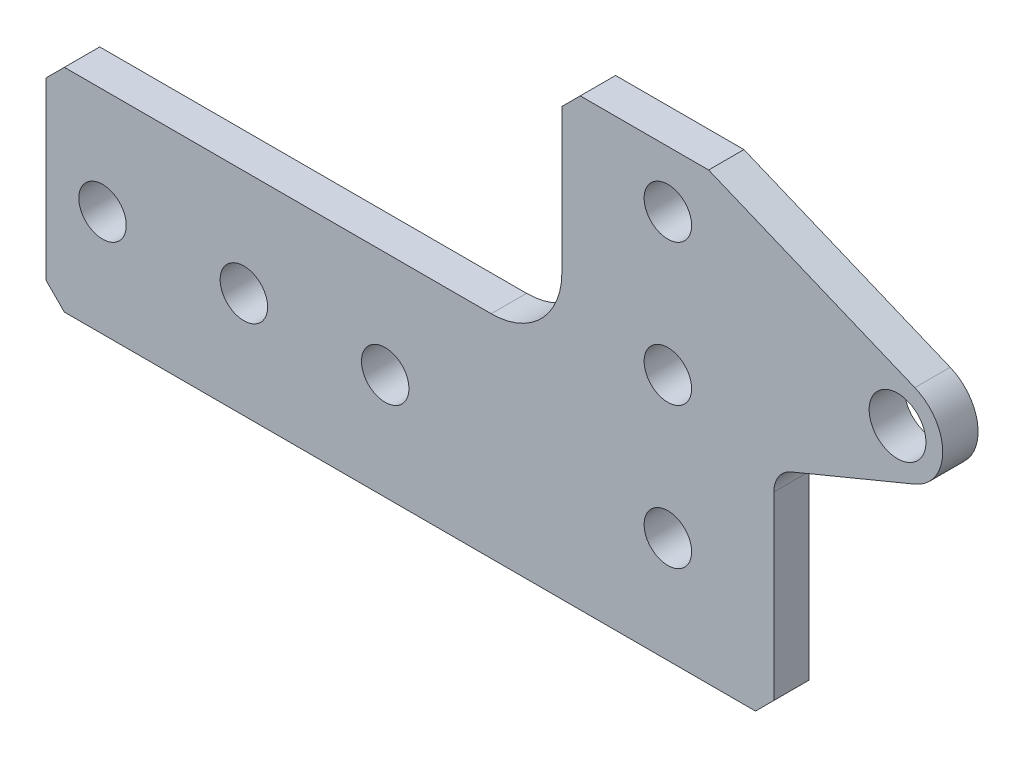
ISO-10303-21;
HEADER;
FILE_DESCRIPTION(('STEP AP214'),'2;1');
FILE_NAME('part.step','',(''),(''),'','','');
FILE_SCHEMA(('AUTOMOTIVE_DESIGN { 1 0 10303 214 1 1 1 1 }'));
ENDSEC;
DATA;
#1=APPLICATION_CONTEXT('core data for automotive mechanical design processes');
#2=APPLICATION_PROTOCOL_DEFINITION('international standard','automotive_design',2000,#1);
#3=PRODUCT_CONTEXT('',#1,'mechanical');
#4=PRODUCT('Part','Part','',(#3));
#5=PRODUCT_RELATED_PRODUCT_CATEGORY('part','',(#4));
#6=PRODUCT_DEFINITION_FORMATION('','',#4);
#7=PRODUCT_DEFINITION_CONTEXT('part definition',#1,'design');
#8=PRODUCT_DEFINITION('design','',#6,#7);
#9=PRODUCT_DEFINITION_SHAPE('','',#8);
#10=(LENGTH_UNIT() NAMED_UNIT(*) SI_UNIT(.MILLI.,.METRE.));
#11=(NAMED_UNIT(*) PLANE_ANGLE_UNIT() SI_UNIT($,.RADIAN.));
#12=(NAMED_UNIT(*) SI_UNIT($,.STERADIAN.) SOLID_ANGLE_UNIT());
#13=UNCERTAINTY_MEASURE_WITH_UNIT(LENGTH_MEASURE(1.E-05),#10,'distance_accuracy_value','');
#14=(GEOMETRIC_REPRESENTATION_CONTEXT(3) GLOBAL_UNCERTAINTY_ASSIGNED_CONTEXT((#13)) GLOBAL_UNIT_ASSIGNED_CONTEXT((#10,
#11,#12)) REPRESENTATION_CONTEXT('',''));
#15=CARTESIAN_POINT('',(0.,0.,0.));
#16=DIRECTION('',(0.,0.,1.));
#17=DIRECTION('',(1.,0.,0.));
#18=AXIS2_PLACEMENT_3D('',#15,#16,#17);
#19=CARTESIAN_POINT('',(0.,0.,3.175));
#20=DIRECTION('',(0.,0.,1.));
#21=DIRECTION('',(1.,0.,0.));
#22=AXIS2_PLACEMENT_3D('',#19,#20,#21);
#23=PLANE('',#22);
#24=CARTESIAN_POINT('',(0.,0.,3.175));
#25=DIRECTION('',(0.,0.,-1.));
#26=DIRECTION('',(-1.,0.,0.));
#27=AXIS2_PLACEMENT_3D('',#24,#25,#26);
#28=CIRCLE('',#27,2.1336);
#29=CARTESIAN_POINT('',(-2.1336,0.,3.175));
#30=VERTEX_POINT('',#29);
#31=EDGE_CURVE('E162',#30,#30,#28,.T.);
#32=ORIENTED_EDGE('',*,*,#31,.T.);
#33=EDGE_LOOP('',(#32));
#34=FACE_BOUND('',#33,.T.);
#35=CARTESIAN_POINT('',(-25.4,-1.77367252013231E-13,3.175));
#36=DIRECTION('',(0.,0.,-1.));
#37=DIRECTION('',(-1.,0.,0.));
#38=AXIS2_PLACEMENT_3D('',#35,#36,#37);
#39=CIRCLE('',#38,2.1336);
#40=CARTESIAN_POINT('',(-27.5336,-1.77367252013231E-13,3.175));
#41=VERTEX_POINT('',#40);
#42=EDGE_CURVE('E255',#41,#41,#39,.T.);
#43=ORIENTED_EDGE('',*,*,#42,.T.);
#44=EDGE_LOOP('',(#43));
#45=FACE_BOUND('',#44,.T.);
#46=CARTESIAN_POINT('',(-38.1,-2.66050878019847E-13,3.175));
#47=DIRECTION('',(0.,0.,-1.));
#48=DIRECTION('',(-1.,0.,0.));
#49=AXIS2_PLACEMENT_3D('',#46,#47,#48);
#50=CIRCLE('',#49,2.1336);
#51=CARTESIAN_POINT('',(-40.2336,-2.66050878019847E-13,3.175));
#52=VERTEX_POINT('',#51);
#53=EDGE_CURVE('E258',#52,#52,#50,.T.);
#54=ORIENTED_EDGE('',*,*,#53,.T.);
#55=EDGE_LOOP('',(#54));
#56=FACE_BOUND('',#55,.T.);
#57=CARTESIAN_POINT('',(-50.8,-3.54734504026462E-13,3.175));
#58=DIRECTION('',(0.,0.,-1.));
#59=DIRECTION('',(-1.,0.,0.));
#60=AXIS2_PLACEMENT_3D('',#57,#58,#59);
#61=CIRCLE('',#60,2.1336);
#62=CARTESIAN_POINT('',(-52.9336,-3.54734504026462E-13,3.175));
#63=VERTEX_POINT('',#62);
#64=EDGE_CURVE('E261',#63,#63,#61,.T.);
#65=ORIENTED_EDGE('',*,*,#64,.T.);
#66=EDGE_LOOP('',(#65));
#67=FACE_BOUND('',#66,.T.);
#68=CARTESIAN_POINT('',(-1.33025439009923E-13,12.7,3.175));
#69=DIRECTION('',(0.,0.,-1.));
#70=DIRECTION('',(-1.,0.,0.));
#71=AXIS2_PLACEMENT_3D('',#68,#69,#70);
#72=CIRCLE('',#71,2.1336);
#73=CARTESIAN_POINT('',(-2.13360000000013,12.7,3.175));
#74=VERTEX_POINT('',#73);
#75=EDGE_CURVE('E264',#74,#74,#72,.T.);
#76=ORIENTED_EDGE('',*,*,#75,.T.);
#77=EDGE_LOOP('',(#76));
#78=FACE_BOUND('',#77,.T.);
#79=CARTESIAN_POINT('',(-2.66050878019847E-13,25.4,3.175));
#80=DIRECTION('',(0.,0.,-1.));
#81=DIRECTION('',(-1.,0.,0.));
#82=AXIS2_PLACEMENT_3D('',#79,#80,#81);
#83=CIRCLE('',#82,2.1336);
#84=CARTESIAN_POINT('',(-2.13360000000027,25.4,3.175));
#85=VERTEX_POINT('',#84);
#86=EDGE_CURVE('E267',#85,#85,#83,.T.);
#87=ORIENTED_EDGE('',*,*,#86,.T.);
#88=EDGE_LOOP('',(#87));
#89=FACE_BOUND('',#88,.T.);
#90=CARTESIAN_POINT('',(20.6374999999998,19.0500000000002,3.175));
#91=DIRECTION('',(0.,0.,-1.));
#92=DIRECTION('',(-1.,0.,0.));
#93=AXIS2_PLACEMENT_3D('',#90,#91,#92);
#94=CIRCLE('',#93,2.5527);
#95=CARTESIAN_POINT('',(18.0847999999998,19.0500000000002,3.175));
#96=VERTEX_POINT('',#95);
#97=EDGE_CURVE('E179',#96,#96,#94,.T.);
#98=ORIENTED_EDGE('',*,*,#97,.T.);
#99=EDGE_LOOP('',(#98));
#100=FACE_BOUND('',#99,.T.);
#101=DIRECTION('',(0.923879532511288,0.382683432365088,0.));
#102=VECTOR('',#101,1.);
#103=CARTESIAN_POINT('',(-2.15767472003884,5.20908757230737,3.175));
#104=LINE('',#103,#102);
#105=CARTESIAN_POINT('',(22.1927254691316,15.2953535798742,3.175));
#106=VERTEX_POINT('',#105);
#107=CARTESIAN_POINT('',(11.0929840817927,10.6976901584044,3.175));
#108=VERTEX_POINT('',#107);
#109=EDGE_CURVE('E185',#106,#108,#104,.F.);
#110=ORIENTED_EDGE('',*,*,#109,.F.);
#111=CARTESIAN_POINT('',(20.6374999999998,19.0500000000002,3.175));
#112=DIRECTION('',(0.,0.,-1.));
#113=DIRECTION('',(-1.,0.,0.));
#114=AXIS2_PLACEMENT_3D('',#111,#112,#113);
#115=CIRCLE('',#114,4.06399999999996);
#116=CARTESIAN_POINT('',(22.1927254691316,22.8046464201259,3.175));
#117=VERTEX_POINT('',#116);
#118=EDGE_CURVE('E272',#117,#106,#115,.T.);
#119=ORIENTED_EDGE('',*,*,#118,.F.);
#120=DIRECTION('',(-0.923879532511288,0.382683432365087,0.));
#121=VECTOR('',#120,1.);
#122=CARTESIAN_POINT('',(11.3127094615648,27.3112966092964,3.175));
#123=LINE('',#122,#121);
#124=CARTESIAN_POINT('',(3.66278276059055,30.48,3.175));
#125=VERTEX_POINT('',#124);
#126=EDGE_CURVE('E171',#125,#117,#123,.F.);
#127=ORIENTED_EDGE('',*,*,#126,.F.);
#128=DIRECTION('',(1.,0.,0.));
#129=VECTOR('',#128,1.);
#130=CARTESIAN_POINT('',(0.,30.48,3.175));
#131=LINE('',#130,#129);
#132=CARTESIAN_POINT('',(-7.874,30.48,3.175));
#133=VERTEX_POINT('',#132);
#134=EDGE_CURVE('E176',#125,#133,#131,.F.);
#135=ORIENTED_EDGE('',*,*,#134,.T.);
#136=DIRECTION('',(0.70710678118655,0.707106781186545,0.));
#137=VECTOR('',#136,1.);
#138=CARTESIAN_POINT('',(-9.525,28.829,3.175));
#139=LINE('',#138,#137);
#140=CARTESIAN_POINT('',(-9.525,28.829,3.175));
#141=VERTEX_POINT('',#140);
#142=EDGE_CURVE('E155',#133,#141,#139,.F.);
#143=ORIENTED_EDGE('',*,*,#142,.T.);
#144=DIRECTION('',(0.,1.,0.));
#145=VECTOR('',#144,1.);
#146=CARTESIAN_POINT('',(-9.525,0.,3.175));
#147=LINE('',#146,#145);
#148=CARTESIAN_POINT('',(-9.525,15.8749999999998,3.175));
#149=VERTEX_POINT('',#148);
#150=EDGE_CURVE('E122',#141,#149,#147,.F.);
#151=ORIENTED_EDGE('',*,*,#150,.T.);
#152=CARTESIAN_POINT('',(-15.875,15.8749999999998,3.175));
#153=DIRECTION('',(0.,0.,1.));
#154=DIRECTION('',(1.,0.,0.));
#155=AXIS2_PLACEMENT_3D('',#152,#153,#154);
#156=CIRCLE('',#155,6.35);
#157=CARTESIAN_POINT('',(-15.875,9.52499999999978,3.175));
#158=VERTEX_POINT('',#157);
#159=EDGE_CURVE('E20',#149,#158,#156,.F.);
#160=ORIENTED_EDGE('',*,*,#159,.T.);
#161=DIRECTION('',(1.,0.,0.));
#162=VECTOR('',#161,1.);
#163=CARTESIAN_POINT('',(0.,9.52499999999978,3.175));
#164=LINE('',#163,#162);
#165=CARTESIAN_POINT('',(-54.229,9.52499999999978,3.175));
#166=VERTEX_POINT('',#165);
#167=EDGE_CURVE('E128',#158,#166,#164,.F.);
#168=ORIENTED_EDGE('',*,*,#167,.T.);
#169=DIRECTION('',(-0.707106781186548,-0.707106781186548,0.));
#170=VECTOR('',#169,1.);
#171=CARTESIAN_POINT('',(-55.88,7.87399999999978,3.175));
#172=LINE('',#171,#170);
#173=CARTESIAN_POINT('',(-55.88,7.87399999999978,3.175));
#174=VERTEX_POINT('',#173);
#175=EDGE_CURVE('E140',#174,#166,#172,.F.);
#176=ORIENTED_EDGE('',*,*,#175,.F.);
#177=DIRECTION('',(0.,1.,0.));
#178=VECTOR('',#177,1.);
#179=CARTESIAN_POINT('',(-55.88,0.,3.175));
#180=LINE('',#179,#178);
#181=CARTESIAN_POINT('',(-55.88,-7.87400000000024,3.175));
#182=VERTEX_POINT('',#181);
#183=EDGE_CURVE('E211',#182,#174,#180,.T.);
#184=ORIENTED_EDGE('',*,*,#183,.F.);
#185=DIRECTION('',(-0.707106781186548,0.707106781186548,0.));
#186=VECTOR('',#185,1.);
#187=CARTESIAN_POINT('',(-54.229,-9.52500000000022,3.175));
#188=LINE('',#187,#186);
#189=CARTESIAN_POINT('',(-54.229,-9.52500000000022,3.175));
#190=VERTEX_POINT('',#189);
#191=EDGE_CURVE('E203',#182,#190,#188,.F.);
#192=ORIENTED_EDGE('',*,*,#191,.T.);
#193=DIRECTION('',(1.,0.,0.));
#194=VECTOR('',#193,1.);
#195=CARTESIAN_POINT('',(0.,-9.52500000000022,3.175));
#196=LINE('',#195,#194);
#197=CARTESIAN_POINT('',(7.87400000000001,-9.52500000000022,3.175));
#198=VERTEX_POINT('',#197);
#199=EDGE_CURVE('E201',#198,#190,#196,.F.);
#200=ORIENTED_EDGE('',*,*,#199,.F.);
#201=DIRECTION('',(0.707106781186548,0.707106781186548,0.));
#202=VECTOR('',#201,1.);
#203=CARTESIAN_POINT('',(9.525,-7.87400000000023,3.175));
#204=LINE('',#203,#202);
#205=CARTESIAN_POINT('',(9.525,-7.87400000000023,3.175));
#206=VERTEX_POINT('',#205);
#207=EDGE_CURVE('E195',#206,#198,#204,.F.);
#208=ORIENTED_EDGE('',*,*,#207,.F.);
#209=DIRECTION('',(0.,1.,0.));
#210=VECTOR('',#209,1.);
#211=CARTESIAN_POINT('',(9.525,0.,3.175));
#212=LINE('',#211,#210);
#213=CARTESIAN_POINT('',(9.525,8.3510361458257,3.175));
#214=VERTEX_POINT('',#213);
#215=EDGE_CURVE('E189',#206,#214,#212,.T.);
#216=ORIENTED_EDGE('',*,*,#215,.T.);
#217=CARTESIAN_POINT('',(12.065,8.3510361458257,3.175));
#218=DIRECTION('',(0.,0.,-1.));
#219=DIRECTION('',(-1.,0.,0.));
#220=AXIS2_PLACEMENT_3D('',#217,#218,#219);
#221=CIRCLE('',#220,2.54);
#222=EDGE_CURVE('E188',#214,#108,#221,.T.);
#223=ORIENTED_EDGE('',*,*,#222,.T.);
#224=EDGE_LOOP('',(#110,#119,#127,#135,#143,#151,#160,#168,#176,#184,#192,#200,#208,#216,#223));
#225=FACE_BOUND('',#224,.T.);
#226=ADVANCED_FACE('F17',(#34,#45,#56,#67,#78,#89,#100,#225),#23,.T.);
#227=CARTESIAN_POINT('',(-9.525,28.829,3.175));
#228=DIRECTION('',(0.707106781186545,-0.70710678118655,0.));
#229=DIRECTION('',(0.70710678118655,0.707106781186545,0.));
#230=AXIS2_PLACEMENT_3D('',#227,#228,#229);
#231=PLANE('',#230);
#232=DIRECTION('',(0.,0.,1.));
#233=VECTOR('',#232,1.);
#234=CARTESIAN_POINT('',(-7.874,30.48,3.175));
#235=LINE('',#234,#233);
#236=CARTESIAN_POINT('',(-7.874,30.48,0.));
#237=VERTEX_POINT('',#236);
#238=EDGE_CURVE('E165',#133,#237,#235,.F.);
#239=ORIENTED_EDGE('',*,*,#238,.T.);
#240=DIRECTION('',(-0.707106781186551,-0.707106781186544,0.));
#241=VECTOR('',#240,1.);
#242=CARTESIAN_POINT('',(-7.874,30.48,0.));
#243=LINE('',#242,#241);
#244=CARTESIAN_POINT('',(-9.525,28.829,0.));
#245=VERTEX_POINT('',#244);
#246=EDGE_CURVE('E158',#237,#245,#243,.T.);
#247=ORIENTED_EDGE('',*,*,#246,.T.);
#248=DIRECTION('',(0.,0.,1.));
#249=VECTOR('',#248,1.);
#250=CARTESIAN_POINT('',(-9.525,28.829,3.175));
#251=LINE('',#250,#249);
#252=EDGE_CURVE('E152',#245,#141,#251,.T.);
#253=ORIENTED_EDGE('',*,*,#252,.T.);
#254=ORIENTED_EDGE('',*,*,#142,.F.);
#255=EDGE_LOOP('',(#239,#247,#253,#254));
#256=FACE_BOUND('',#255,.T.);
#257=ADVANCED_FACE('F580',(#256),#231,.F.);
#258=CARTESIAN_POINT('',(-9.525,0.,3.175));
#259=DIRECTION('',(1.,0.,0.));
#260=DIRECTION('',(0.,1.,0.));
#261=AXIS2_PLACEMENT_3D('',#258,#259,#260);
#262=PLANE('',#261);
#263=ORIENTED_EDGE('',*,*,#252,.F.);
#264=DIRECTION('',(0.,1.,0.));
#265=VECTOR('',#264,1.);
#266=CARTESIAN_POINT('',(-9.525,0.,0.));
#267=LINE('',#266,#265);
#268=CARTESIAN_POINT('',(-9.525,15.8749999999998,0.));
#269=VERTEX_POINT('',#268);
#270=EDGE_CURVE('E161',#245,#269,#267,.F.);
#271=ORIENTED_EDGE('',*,*,#270,.T.);
#272=DIRECTION('',(0.,0.,1.));
#273=VECTOR('',#272,1.);
#274=CARTESIAN_POINT('',(-9.525,15.8749999999998,3.175));
#275=LINE('',#274,#273);
#276=EDGE_CURVE('E134',#269,#149,#275,.T.);
#277=ORIENTED_EDGE('',*,*,#276,.T.);
#278=ORIENTED_EDGE('',*,*,#150,.F.);
#279=EDGE_LOOP('',(#263,#271,#277,#278));
#280=FACE_BOUND('',#279,.T.);
#281=ADVANCED_FACE('F572',(#280),#262,.F.);
#282=CARTESIAN_POINT('',(-15.875,15.8749999999998,3.175));
#283=DIRECTION('',(0.,0.,1.));
#284=DIRECTION('',(1.,0.,0.));
#285=AXIS2_PLACEMENT_3D('',#282,#283,#284);
#286=CYLINDRICAL_SURFACE('',#285,6.35);
#287=ORIENTED_EDGE('',*,*,#276,.F.);
#288=CARTESIAN_POINT('',(-15.875,15.8749999999998,0.));
#289=DIRECTION('',(0.,0.,1.));
#290=DIRECTION('',(1.,0.,0.));
#291=AXIS2_PLACEMENT_3D('',#288,#289,#290);
#292=CIRCLE('',#291,6.35);
#293=CARTESIAN_POINT('',(-15.875,9.52499999999978,0.));
#294=VERTEX_POINT('',#293);
#295=EDGE_CURVE('E145',#269,#294,#292,.F.);
#296=ORIENTED_EDGE('',*,*,#295,.T.);
#297=DIRECTION('',(0.,0.,1.));
#298=VECTOR('',#297,1.);
#299=CARTESIAN_POINT('',(-15.875,9.52499999999978,3.175));
#300=LINE('',#299,#298);
#301=EDGE_CURVE('E133',#294,#158,#300,.T.);
#302=ORIENTED_EDGE('',*,*,#301,.T.);
#303=ORIENTED_EDGE('',*,*,#159,.F.);
#304=EDGE_LOOP('',(#287,#296,#302,#303));
#305=FACE_BOUND('',#304,.T.);
#306=ADVANCED_FACE('F143',(#305),#286,.F.);
#307=CARTESIAN_POINT('',(0.,9.52499999999978,3.175));
#308=DIRECTION('',(0.,-1.,0.));
#309=DIRECTION('',(1.,0.,0.));
#310=AXIS2_PLACEMENT_3D('',#307,#308,#309);
#311=PLANE('',#310);
#312=DIRECTION('',(0.,0.,1.));
#313=VECTOR('',#312,1.);
#314=CARTESIAN_POINT('',(-54.229,9.52499999999978,3.175));
#315=LINE('',#314,#313);
#316=CARTESIAN_POINT('',(-54.229,9.52499999999977,0.));
#317=VERTEX_POINT('',#316);
#318=EDGE_CURVE('E139',#166,#317,#315,.F.);
#319=ORIENTED_EDGE('',*,*,#318,.F.);
#320=ORIENTED_EDGE('',*,*,#167,.F.);
#321=ORIENTED_EDGE('',*,*,#301,.F.);
#322=DIRECTION('',(1.,0.,0.));
#323=VECTOR('',#322,1.);
#324=CARTESIAN_POINT('',(0.,9.52499999999978,0.));
#325=LINE('',#324,#323);
#326=EDGE_CURVE('E252',#294,#317,#325,.F.);
#327=ORIENTED_EDGE('',*,*,#326,.T.);
#328=EDGE_LOOP('',(#319,#320,#321,#327));
#329=FACE_BOUND('',#328,.T.);
#330=ADVANCED_FACE('F136',(#329),#311,.F.);
#331=CARTESIAN_POINT('',(-55.88,7.87399999999978,3.175));
#332=DIRECTION('',(-0.707106781186548,0.707106781186548,0.));
#333=DIRECTION('',(-0.707106781186548,-0.707106781186548,0.));
#334=AXIS2_PLACEMENT_3D('',#331,#332,#333);
#335=PLANE('',#334);
#336=DIRECTION('',(-0.707106781186547,-0.707106781186547,0.));
#337=VECTOR('',#336,1.);
#338=CARTESIAN_POINT('',(-54.229,9.52499999999978,0.));
#339=LINE('',#338,#337);
#340=CARTESIAN_POINT('',(-55.88,7.87399999999978,0.));
#341=VERTEX_POINT('',#340);
#342=EDGE_CURVE('E316',#317,#341,#339,.T.);
#343=ORIENTED_EDGE('',*,*,#342,.T.);
#344=DIRECTION('',(0.,0.,1.));
#345=VECTOR('',#344,1.);
#346=CARTESIAN_POINT('',(-55.88,7.87399999999978,3.175));
#347=LINE('',#346,#345);
#348=EDGE_CURVE('E213',#174,#341,#347,.F.);
#349=ORIENTED_EDGE('',*,*,#348,.F.);
#350=ORIENTED_EDGE('',*,*,#175,.T.);
#351=ORIENTED_EDGE('',*,*,#318,.T.);
#352=EDGE_LOOP('',(#343,#349,#350,#351));
#353=FACE_BOUND('',#352,.T.);
#354=ADVANCED_FACE('F327',(#353),#335,.T.);
#355=CARTESIAN_POINT('',(-55.88,0.,3.175));
#356=DIRECTION('',(-1.,0.,0.));
#357=DIRECTION('',(0.,0.,1.));
#358=AXIS2_PLACEMENT_3D('',#355,#356,#357);
#359=PLANE('',#358);
#360=DIRECTION('',(0.,1.,0.));
#361=VECTOR('',#360,1.);
#362=CARTESIAN_POINT('',(-55.88,0.,0.));
#363=LINE('',#362,#361);
#364=CARTESIAN_POINT('',(-55.88,-7.87400000000023,0.));
#365=VERTEX_POINT('',#364);
#366=EDGE_CURVE('E307',#341,#365,#363,.F.);
#367=ORIENTED_EDGE('',*,*,#366,.T.);
#368=DIRECTION('',(0.,0.,1.));
#369=VECTOR('',#368,1.);
#370=CARTESIAN_POINT('',(-55.88,-7.87400000000024,3.175));
#371=LINE('',#370,#369);
#372=EDGE_CURVE('E208',#365,#182,#371,.T.);
#373=ORIENTED_EDGE('',*,*,#372,.T.);
#374=ORIENTED_EDGE('',*,*,#183,.T.);
#375=ORIENTED_EDGE('',*,*,#348,.T.);
#376=EDGE_LOOP('',(#367,#373,#374,#375));
#377=FACE_BOUND('',#376,.T.);
#378=ADVANCED_FACE('F382',(#377),#359,.T.);
#379=CARTESIAN_POINT('',(-54.229,-9.52500000000022,3.175));
#380=DIRECTION('',(0.707106781186548,0.707106781186548,0.));
#381=DIRECTION('',(-0.707106781186548,0.707106781186548,0.));
#382=AXIS2_PLACEMENT_3D('',#379,#380,#381);
#383=PLANE('',#382);
#384=ORIENTED_EDGE('',*,*,#372,.F.);
#385=DIRECTION('',(0.707106781186548,-0.707106781186548,0.));
#386=VECTOR('',#385,1.);
#387=CARTESIAN_POINT('',(-55.88,-7.87400000000024,0.));
#388=LINE('',#387,#386);
#389=CARTESIAN_POINT('',(-54.229,-9.52500000000022,0.));
#390=VERTEX_POINT('',#389);
#391=EDGE_CURVE('E299',#365,#390,#388,.T.);
#392=ORIENTED_EDGE('',*,*,#391,.T.);
#393=DIRECTION('',(0.,0.,1.));
#394=VECTOR('',#393,1.);
#395=CARTESIAN_POINT('',(-54.229,-9.52500000000022,3.175));
#396=LINE('',#395,#394);
#397=EDGE_CURVE('E198',#190,#390,#396,.F.);
#398=ORIENTED_EDGE('',*,*,#397,.F.);
#399=ORIENTED_EDGE('',*,*,#191,.F.);
#400=EDGE_LOOP('',(#384,#392,#398,#399));
#401=FACE_BOUND('',#400,.T.);
#402=ADVANCED_FACE('F379',(#401),#383,.F.);
#403=CARTESIAN_POINT('',(0.,-9.52500000000022,3.175));
#404=DIRECTION('',(0.,-1.,0.));
#405=DIRECTION('',(1.,0.,0.));
#406=AXIS2_PLACEMENT_3D('',#403,#404,#405);
#407=PLANE('',#406);
#408=ORIENTED_EDGE('',*,*,#199,.T.);
#409=ORIENTED_EDGE('',*,*,#397,.T.);
#410=DIRECTION('',(1.,0.,0.));
#411=VECTOR('',#410,1.);
#412=CARTESIAN_POINT('',(0.,-9.52500000000022,0.));
#413=LINE('',#412,#411);
#414=CARTESIAN_POINT('',(7.87400000000001,-9.52500000000022,0.));
#415=VERTEX_POINT('',#414);
#416=EDGE_CURVE('E291',#390,#415,#413,.T.);
#417=ORIENTED_EDGE('',*,*,#416,.T.);
#418=DIRECTION('',(0.,0.,1.));
#419=VECTOR('',#418,1.);
#420=CARTESIAN_POINT('',(7.87400000000001,-9.52500000000022,3.175));
#421=LINE('',#420,#419);
#422=EDGE_CURVE('E197',#198,#415,#421,.F.);
#423=ORIENTED_EDGE('',*,*,#422,.F.);
#424=EDGE_LOOP('',(#408,#409,#417,#423));
#425=FACE_BOUND('',#424,.T.);
#426=ADVANCED_FACE('F376',(#425),#407,.T.);
#427=CARTESIAN_POINT('',(9.525,-7.87400000000023,3.175));
#428=DIRECTION('',(0.707106781186548,-0.707106781186548,0.));
#429=DIRECTION('',(0.707106781186548,0.707106781186548,0.));
#430=AXIS2_PLACEMENT_3D('',#427,#428,#429);
#431=PLANE('',#430);
#432=DIRECTION('',(0.707106781186548,0.707106781186548,0.));
#433=VECTOR('',#432,1.);
#434=CARTESIAN_POINT('',(7.87400000000001,-9.52500000000022,0.));
#435=LINE('',#434,#433);
#436=CARTESIAN_POINT('',(9.525,-7.87400000000023,0.));
#437=VERTEX_POINT('',#436);
#438=EDGE_CURVE('E288',#415,#437,#435,.T.);
#439=ORIENTED_EDGE('',*,*,#438,.T.);
#440=DIRECTION('',(0.,0.,1.));
#441=VECTOR('',#440,1.);
#442=CARTESIAN_POINT('',(9.525,-7.87400000000023,3.175));
#443=LINE('',#442,#441);
#444=EDGE_CURVE('E192',#437,#206,#443,.T.);
#445=ORIENTED_EDGE('',*,*,#444,.T.);
#446=ORIENTED_EDGE('',*,*,#207,.T.);
#447=ORIENTED_EDGE('',*,*,#422,.T.);
#448=EDGE_LOOP('',(#439,#445,#446,#447));
#449=FACE_BOUND('',#448,.T.);
#450=ADVANCED_FACE('F372',(#449),#431,.T.);
#451=CARTESIAN_POINT('',(9.525,0.,3.175));
#452=DIRECTION('',(-1.,0.,0.));
#453=DIRECTION('',(0.,0.,1.));
#454=AXIS2_PLACEMENT_3D('',#451,#452,#453);
#455=PLANE('',#454);
#456=ORIENTED_EDGE('',*,*,#444,.F.);
#457=DIRECTION('',(0.,1.,0.));
#458=VECTOR('',#457,1.);
#459=CARTESIAN_POINT('',(9.525,0.,0.));
#460=LINE('',#459,#458);
#461=CARTESIAN_POINT('',(9.525,8.3510361458257,0.));
#462=VERTEX_POINT('',#461);
#463=EDGE_CURVE('E250',#437,#462,#460,.T.);
#464=ORIENTED_EDGE('',*,*,#463,.T.);
#465=DIRECTION('',(0.,0.,-1.));
#466=VECTOR('',#465,1.);
#467=CARTESIAN_POINT('',(9.525,8.3510361458257,3.175));
#468=LINE('',#467,#466);
#469=EDGE_CURVE('E191',#462,#214,#468,.F.);
#470=ORIENTED_EDGE('',*,*,#469,.T.);
#471=ORIENTED_EDGE('',*,*,#215,.F.);
#472=EDGE_LOOP('',(#456,#464,#470,#471));
#473=FACE_BOUND('',#472,.T.);
#474=ADVANCED_FACE('F368',(#473),#455,.F.);
#475=CARTESIAN_POINT('',(12.065,8.3510361458257,3.175));
#476=DIRECTION('',(0.,0.,-1.));
#477=DIRECTION('',(-1.,0.,0.));
#478=AXIS2_PLACEMENT_3D('',#475,#476,#477);
#479=CYLINDRICAL_SURFACE('',#478,2.54);
#480=ORIENTED_EDGE('',*,*,#469,.F.);
#481=CARTESIAN_POINT('',(12.065,8.3510361458257,0.));
#482=DIRECTION('',(0.,0.,-1.));
#483=DIRECTION('',(-1.,0.,0.));
#484=AXIS2_PLACEMENT_3D('',#481,#482,#483);
#485=CIRCLE('',#484,2.54);
#486=CARTESIAN_POINT('',(11.0929840817927,10.6976901584044,0.));
#487=VERTEX_POINT('',#486);
#488=EDGE_CURVE('E247',#462,#487,#485,.T.);
#489=ORIENTED_EDGE('',*,*,#488,.T.);
#490=DIRECTION('',(0.,0.,1.));
#491=VECTOR('',#490,1.);
#492=CARTESIAN_POINT('',(11.0929840817927,10.6976901584044,3.175));
#493=LINE('',#492,#491);
#494=EDGE_CURVE('E187',#108,#487,#493,.F.);
#495=ORIENTED_EDGE('',*,*,#494,.F.);
#496=ORIENTED_EDGE('',*,*,#222,.F.);
#497=EDGE_LOOP('',(#480,#489,#495,#496));
#498=FACE_BOUND('',#497,.T.);
#499=ADVANCED_FACE('F384',(#498),#479,.F.);
#500=CARTESIAN_POINT('',(-2.15767472003884,5.20908757230737,3.175));
#501=DIRECTION('',(0.382683432365088,-0.923879532511288,0.));
#502=DIRECTION('',(0.923879532511288,0.382683432365088,0.));
#503=AXIS2_PLACEMENT_3D('',#500,#501,#502);
#504=PLANE('',#503);
#505=DIRECTION('',(0.923879532511288,0.382683432365088,0.));
#506=VECTOR('',#505,1.);
#507=CARTESIAN_POINT('',(11.0929840817927,10.6976901584044,0.));
#508=LINE('',#507,#506);
#509=CARTESIAN_POINT('',(22.1927254691316,15.2953535798742,0.));
#510=VERTEX_POINT('',#509);
#511=EDGE_CURVE('E246',#487,#510,#508,.T.);
#512=ORIENTED_EDGE('',*,*,#511,.T.);
#513=DIRECTION('',(0.,0.,-1.));
#514=VECTOR('',#513,1.);
#515=CARTESIAN_POINT('',(22.1927254691316,15.2953535798744,3.175));
#516=LINE('',#515,#514);
#517=EDGE_CURVE('E173',#106,#510,#516,.T.);
#518=ORIENTED_EDGE('',*,*,#517,.F.);
#519=ORIENTED_EDGE('',*,*,#109,.T.);
#520=ORIENTED_EDGE('',*,*,#494,.T.);
#521=EDGE_LOOP('',(#512,#518,#519,#520));
#522=FACE_BOUND('',#521,.T.);
#523=ADVANCED_FACE('F362',(#522),#504,.T.);
#524=CARTESIAN_POINT('',(20.6374999999998,19.0500000000002,3.175));
#525=DIRECTION('',(0.,0.,-1.));
#526=DIRECTION('',(-1.,0.,0.));
#527=AXIS2_PLACEMENT_3D('',#524,#525,#526);
#528=CYLINDRICAL_SURFACE('',#527,4.06399999999996);
#529=ORIENTED_EDGE('',*,*,#118,.T.);
#530=ORIENTED_EDGE('',*,*,#517,.T.);
#531=CARTESIAN_POINT('',(20.6374999999998,19.0500000000002,0.));
#532=DIRECTION('',(0.,0.,-1.));
#533=DIRECTION('',(-1.,0.,0.));
#534=AXIS2_PLACEMENT_3D('',#531,#532,#533);
#535=CIRCLE('',#534,4.06399999999996);
#536=CARTESIAN_POINT('',(22.1927254691316,22.8046464201259,0.));
#537=VERTEX_POINT('',#536);
#538=EDGE_CURVE('E242',#510,#537,#535,.F.);
#539=ORIENTED_EDGE('',*,*,#538,.T.);
#540=DIRECTION('',(0.,0.,1.));
#541=VECTOR('',#540,1.);
#542=CARTESIAN_POINT('',(22.1927254691317,22.8046464201259,3.175));
#543=LINE('',#542,#541);
#544=EDGE_CURVE('E168',#117,#537,#543,.F.);
#545=ORIENTED_EDGE('',*,*,#544,.F.);
#546=EDGE_LOOP('',(#529,#530,#539,#545));
#547=FACE_BOUND('',#546,.T.);
#548=ADVANCED_FACE('F354',(#547),#528,.T.);
#549=CARTESIAN_POINT('',(11.3127094615648,27.3112966092964,3.175));
#550=DIRECTION('',(0.382683432365087,0.923879532511288,0.));
#551=DIRECTION('',(-0.923879532511288,0.382683432365087,0.));
#552=AXIS2_PLACEMENT_3D('',#549,#550,#551);
#553=PLANE('',#552);
#554=ORIENTED_EDGE('',*,*,#126,.T.);
#555=ORIENTED_EDGE('',*,*,#544,.T.);
#556=DIRECTION('',(-0.923879532511288,0.382683432365087,0.));
#557=VECTOR('',#556,1.);
#558=CARTESIAN_POINT('',(22.1927254691317,22.8046464201259,0.));
#559=LINE('',#558,#557);
#560=CARTESIAN_POINT('',(3.66278276059055,30.48,0.));
#561=VERTEX_POINT('',#560);
#562=EDGE_CURVE('E245',#537,#561,#559,.T.);
#563=ORIENTED_EDGE('',*,*,#562,.T.);
#564=DIRECTION('',(0.,0.,1.));
#565=VECTOR('',#564,1.);
#566=CARTESIAN_POINT('',(3.66278276059055,30.48,3.175));
#567=LINE('',#566,#565);
#568=EDGE_CURVE('E35',#561,#125,#567,.T.);
#569=ORIENTED_EDGE('',*,*,#568,.T.);
#570=EDGE_LOOP('',(#554,#555,#563,#569));
#571=FACE_BOUND('',#570,.T.);
#572=ADVANCED_FACE('F433',(#571),#553,.T.);
#573=CARTESIAN_POINT('',(0.,30.48,3.175));
#574=DIRECTION('',(0.,-1.,0.));
#575=DIRECTION('',(1.,0.,0.));
#576=AXIS2_PLACEMENT_3D('',#573,#574,#575);
#577=PLANE('',#576);
#578=ORIENTED_EDGE('',*,*,#568,.F.);
#579=DIRECTION('',(1.,0.,0.));
#580=VECTOR('',#579,1.);
#581=CARTESIAN_POINT('',(0.,30.48,0.));
#582=LINE('',#581,#580);
#583=EDGE_CURVE('E241',#561,#237,#582,.F.);
#584=ORIENTED_EDGE('',*,*,#583,.T.);
#585=ORIENTED_EDGE('',*,*,#238,.F.);
#586=ORIENTED_EDGE('',*,*,#134,.F.);
#587=EDGE_LOOP('',(#578,#584,#585,#586));
#588=FACE_BOUND('',#587,.T.);
#589=ADVANCED_FACE('F429',(#588),#577,.F.);
#590=CARTESIAN_POINT('',(20.6374999999998,19.0500000000002,3.175));
#591=DIRECTION('',(0.,0.,-1.));
#592=DIRECTION('',(-1.,0.,0.));
#593=AXIS2_PLACEMENT_3D('',#590,#591,#592);
#594=CYLINDRICAL_SURFACE('',#593,2.5527);
#595=CARTESIAN_POINT('',(20.6374999999998,19.0500000000002,0.));
#596=DIRECTION('',(0.,0.,-1.));
#597=DIRECTION('',(-1.,0.,0.));
#598=AXIS2_PLACEMENT_3D('',#595,#596,#597);
#599=CIRCLE('',#598,2.5527);
#600=CARTESIAN_POINT('',(18.0847999999998,19.0500000000002,0.));
#601=VERTEX_POINT('',#600);
#602=EDGE_CURVE('E238',#601,#601,#599,.T.);
#603=ORIENTED_EDGE('',*,*,#602,.T.);
#604=EDGE_LOOP('',(#603));
#605=FACE_BOUND('',#604,.T.);
#606=ORIENTED_EDGE('',*,*,#97,.F.);
#607=EDGE_LOOP('',(#606));
#608=FACE_BOUND('',#607,.T.);
#609=ADVANCED_FACE('F425',(#605,#608),#594,.F.);
#610=CARTESIAN_POINT('',(-2.66050878019847E-13,25.4,3.175));
#611=DIRECTION('',(0.,0.,-1.));
#612=DIRECTION('',(-1.,0.,0.));
#613=AXIS2_PLACEMENT_3D('',#610,#611,#612);
#614=CYLINDRICAL_SURFACE('',#613,2.1336);
#615=CARTESIAN_POINT('',(-2.66050878019847E-13,25.4,0.));
#616=DIRECTION('',(0.,0.,-1.));
#617=DIRECTION('',(-1.,0.,0.));
#618=AXIS2_PLACEMENT_3D('',#615,#616,#617);
#619=CIRCLE('',#618,2.1336);
#620=CARTESIAN_POINT('',(-2.13360000000027,25.4,0.));
#621=VERTEX_POINT('',#620);
#622=EDGE_CURVE('E235',#621,#621,#619,.T.);
#623=ORIENTED_EDGE('',*,*,#622,.T.);
#624=EDGE_LOOP('',(#623));
#625=FACE_BOUND('',#624,.T.);
#626=ORIENTED_EDGE('',*,*,#86,.F.);
#627=EDGE_LOOP('',(#626));
#628=FACE_BOUND('',#627,.T.);
#629=ADVANCED_FACE('F421',(#625,#628),#614,.F.);
#630=CARTESIAN_POINT('',(-1.33025439009923E-13,12.7,3.175));
#631=DIRECTION('',(0.,0.,-1.));
#632=DIRECTION('',(-1.,0.,0.));
#633=AXIS2_PLACEMENT_3D('',#630,#631,#632);
#634=CYLINDRICAL_SURFACE('',#633,2.1336);
#635=CARTESIAN_POINT('',(-1.33025439009923E-13,12.7,0.));
#636=DIRECTION('',(0.,0.,-1.));
#637=DIRECTION('',(-1.,0.,0.));
#638=AXIS2_PLACEMENT_3D('',#635,#636,#637);
#639=CIRCLE('',#638,2.1336);
#640=CARTESIAN_POINT('',(-2.13360000000013,12.7,0.));
#641=VERTEX_POINT('',#640);
#642=EDGE_CURVE('E232',#641,#641,#639,.T.);
#643=ORIENTED_EDGE('',*,*,#642,.T.);
#644=EDGE_LOOP('',(#643));
#645=FACE_BOUND('',#644,.T.);
#646=ORIENTED_EDGE('',*,*,#75,.F.);
#647=EDGE_LOOP('',(#646));
#648=FACE_BOUND('',#647,.T.);
#649=ADVANCED_FACE('F417',(#645,#648),#634,.F.);
#650=CARTESIAN_POINT('',(-50.8,-3.54734504026462E-13,3.175));
#651=DIRECTION('',(0.,0.,-1.));
#652=DIRECTION('',(-1.,0.,0.));
#653=AXIS2_PLACEMENT_3D('',#650,#651,#652);
#654=CYLINDRICAL_SURFACE('',#653,2.1336);
#655=CARTESIAN_POINT('',(-50.8,-3.54734504026462E-13,0.));
#656=DIRECTION('',(0.,0.,-1.));
#657=DIRECTION('',(-1.,0.,0.));
#658=AXIS2_PLACEMENT_3D('',#655,#656,#657);
#659=CIRCLE('',#658,2.1336);
#660=CARTESIAN_POINT('',(-52.9336,-3.54734504026462E-13,0.));
#661=VERTEX_POINT('',#660);
#662=EDGE_CURVE('E229',#661,#661,#659,.T.);
#663=ORIENTED_EDGE('',*,*,#662,.T.);
#664=EDGE_LOOP('',(#663));
#665=FACE_BOUND('',#664,.T.);
#666=ORIENTED_EDGE('',*,*,#64,.F.);
#667=EDGE_LOOP('',(#666));
#668=FACE_BOUND('',#667,.T.);
#669=ADVANCED_FACE('F413',(#665,#668),#654,.F.);
#670=CARTESIAN_POINT('',(-38.1,-2.66050878019847E-13,3.175));
#671=DIRECTION('',(0.,0.,-1.));
#672=DIRECTION('',(-1.,0.,0.));
#673=AXIS2_PLACEMENT_3D('',#670,#671,#672);
#674=CYLINDRICAL_SURFACE('',#673,2.1336);
#675=CARTESIAN_POINT('',(-38.1,-2.66050878019847E-13,0.));
#676=DIRECTION('',(0.,0.,-1.));
#677=DIRECTION('',(-1.,0.,0.));
#678=AXIS2_PLACEMENT_3D('',#675,#676,#677);
#679=CIRCLE('',#678,2.1336);
#680=CARTESIAN_POINT('',(-40.2336,-2.66050878019847E-13,0.));
#681=VERTEX_POINT('',#680);
#682=EDGE_CURVE('E226',#681,#681,#679,.T.);
#683=ORIENTED_EDGE('',*,*,#682,.T.);
#684=EDGE_LOOP('',(#683));
#685=FACE_BOUND('',#684,.T.);
#686=ORIENTED_EDGE('',*,*,#53,.F.);
#687=EDGE_LOOP('',(#686));
#688=FACE_BOUND('',#687,.T.);
#689=ADVANCED_FACE('F409',(#685,#688),#674,.F.);
#690=CARTESIAN_POINT('',(-25.4,-1.77367252013231E-13,3.175));
#691=DIRECTION('',(0.,0.,-1.));
#692=DIRECTION('',(-1.,0.,0.));
#693=AXIS2_PLACEMENT_3D('',#690,#691,#692);
#694=CYLINDRICAL_SURFACE('',#693,2.1336);
#695=CARTESIAN_POINT('',(-25.4,-1.77367252013231E-13,0.));
#696=DIRECTION('',(0.,0.,-1.));
#697=DIRECTION('',(-1.,0.,0.));
#698=AXIS2_PLACEMENT_3D('',#695,#696,#697);
#699=CIRCLE('',#698,2.1336);
#700=CARTESIAN_POINT('',(-27.5336,-1.77367252013231E-13,0.));
#701=VERTEX_POINT('',#700);
#702=EDGE_CURVE('E26',#701,#701,#699,.T.);
#703=ORIENTED_EDGE('',*,*,#702,.T.);
#704=EDGE_LOOP('',(#703));
#705=FACE_BOUND('',#704,.T.);
#706=ORIENTED_EDGE('',*,*,#42,.F.);
#707=EDGE_LOOP('',(#706));
#708=FACE_BOUND('',#707,.T.);
#709=ADVANCED_FACE('F401',(#705,#708),#694,.F.);
#710=CARTESIAN_POINT('',(0.,0.,3.175));
#711=DIRECTION('',(0.,0.,-1.));
#712=DIRECTION('',(-1.,0.,0.));
#713=AXIS2_PLACEMENT_3D('',#710,#711,#712);
#714=CYLINDRICAL_SURFACE('',#713,2.1336);
#715=CARTESIAN_POINT('',(0.,0.,0.));
#716=DIRECTION('',(0.,0.,-1.));
#717=DIRECTION('',(-1.,0.,0.));
#718=AXIS2_PLACEMENT_3D('',#715,#716,#717);
#719=CIRCLE('',#718,2.1336);
#720=CARTESIAN_POINT('',(-2.1336,0.,0.));
#721=VERTEX_POINT('',#720);
#722=EDGE_CURVE('E11',#721,#721,#719,.T.);
#723=ORIENTED_EDGE('',*,*,#722,.T.);
#724=EDGE_LOOP('',(#723));
#725=FACE_BOUND('',#724,.T.);
#726=ORIENTED_EDGE('',*,*,#31,.F.);
#727=EDGE_LOOP('',(#726));
#728=FACE_BOUND('',#727,.T.);
#729=ADVANCED_FACE('F395',(#725,#728),#714,.F.);
#730=CARTESIAN_POINT('',(0.,0.,0.));
#731=DIRECTION('',(0.,0.,1.));
#732=DIRECTION('',(1.,0.,0.));
#733=AXIS2_PLACEMENT_3D('',#730,#731,#732);
#734=PLANE('',#733);
#735=ORIENTED_EDGE('',*,*,#722,.F.);
#736=EDGE_LOOP('',(#735));
#737=FACE_BOUND('',#736,.T.);
#738=ORIENTED_EDGE('',*,*,#702,.F.);
#739=EDGE_LOOP('',(#738));
#740=FACE_BOUND('',#739,.T.);
#741=ORIENTED_EDGE('',*,*,#682,.F.);
#742=EDGE_LOOP('',(#741));
#743=FACE_BOUND('',#742,.T.);
#744=ORIENTED_EDGE('',*,*,#662,.F.);
#745=EDGE_LOOP('',(#744));
#746=FACE_BOUND('',#745,.T.);
#747=ORIENTED_EDGE('',*,*,#642,.F.);
#748=EDGE_LOOP('',(#747));
#749=FACE_BOUND('',#748,.T.);
#750=ORIENTED_EDGE('',*,*,#622,.F.);
#751=EDGE_LOOP('',(#750));
#752=FACE_BOUND('',#751,.T.);
#753=ORIENTED_EDGE('',*,*,#602,.F.);
#754=EDGE_LOOP('',(#753));
#755=FACE_BOUND('',#754,.T.);
#756=ORIENTED_EDGE('',*,*,#562,.F.);
#757=ORIENTED_EDGE('',*,*,#538,.F.);
#758=ORIENTED_EDGE('',*,*,#511,.F.);
#759=ORIENTED_EDGE('',*,*,#488,.F.);
#760=ORIENTED_EDGE('',*,*,#463,.F.);
#761=ORIENTED_EDGE('',*,*,#438,.F.);
#762=ORIENTED_EDGE('',*,*,#416,.F.);
#763=ORIENTED_EDGE('',*,*,#391,.F.);
#764=ORIENTED_EDGE('',*,*,#366,.F.);
#765=ORIENTED_EDGE('',*,*,#342,.F.);
#766=ORIENTED_EDGE('',*,*,#326,.F.);
#767=ORIENTED_EDGE('',*,*,#295,.F.);
#768=ORIENTED_EDGE('',*,*,#270,.F.);
#769=ORIENTED_EDGE('',*,*,#246,.F.);
#770=ORIENTED_EDGE('',*,*,#583,.F.);
#771=EDGE_LOOP('',(#756,#757,#758,#759,#760,#761,#762,#763,#764,#765,#766,#767,#768,#769,#770));
#772=FACE_BOUND('',#771,.T.);
#773=ADVANCED_FACE('F332',(#737,#740,#743,#746,#749,#752,#755,#772),#734,.F.);
#774=CLOSED_SHELL('',(#226,#257,#281,#306,#330,#354,#378,#402,#426,#450,#474,#499,#523,#548,
#572,#589,#609,#629,#649,#669,#689,#709,#729,#773));
#775=MANIFOLD_SOLID_BREP('B1',#774);
#776=ADVANCED_BREP_SHAPE_REPRESENTATION('',(#18,#775),#14);
#777=SHAPE_DEFINITION_REPRESENTATION(#9,#776);
ENDSEC;
END-ISO-10303-21;
